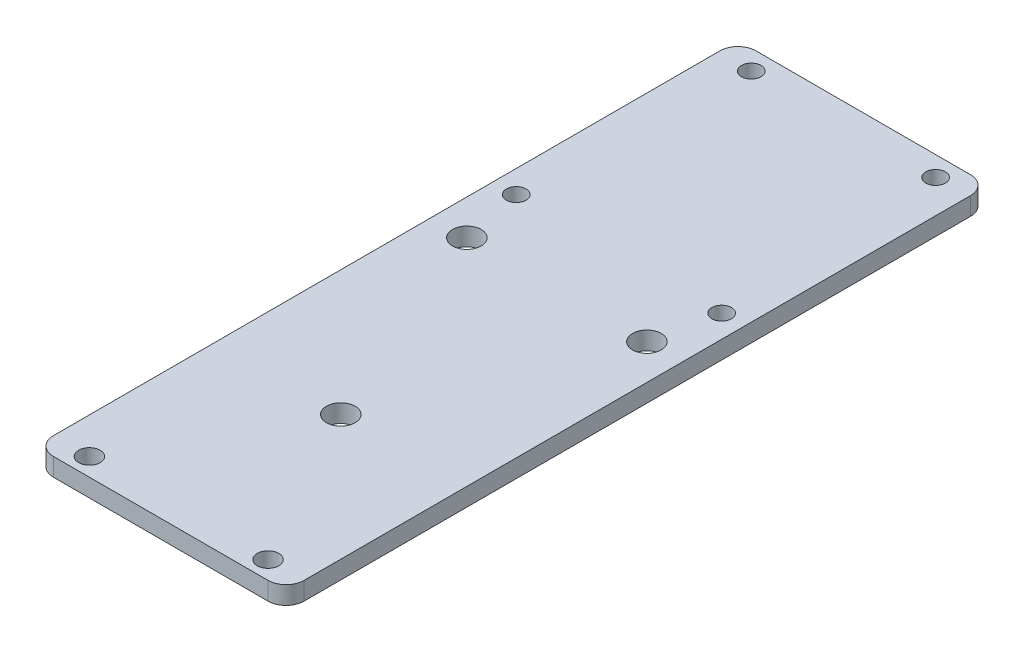
ISO-10303-21;
HEADER;
FILE_DESCRIPTION(('STEP AP214'),'2;1');
FILE_NAME('part.step','',(''),(''),'','','');
FILE_SCHEMA(('AUTOMOTIVE_DESIGN { 1 0 10303 214 1 1 1 1 }'));
ENDSEC;
DATA;
#1=APPLICATION_CONTEXT('core data for automotive mechanical design processes');
#2=APPLICATION_PROTOCOL_DEFINITION('international standard','automotive_design',2000,#1);
#3=PRODUCT_CONTEXT('',#1,'mechanical');
#4=PRODUCT('Part','Part','',(#3));
#5=PRODUCT_RELATED_PRODUCT_CATEGORY('part','',(#4));
#6=PRODUCT_DEFINITION_FORMATION('','',#4);
#7=PRODUCT_DEFINITION_CONTEXT('part definition',#1,'design');
#8=PRODUCT_DEFINITION('design','',#6,#7);
#9=PRODUCT_DEFINITION_SHAPE('','',#8);
#10=(LENGTH_UNIT() NAMED_UNIT(*) SI_UNIT(.MILLI.,.METRE.));
#11=(NAMED_UNIT(*) PLANE_ANGLE_UNIT() SI_UNIT($,.RADIAN.));
#12=(NAMED_UNIT(*) SI_UNIT($,.STERADIAN.) SOLID_ANGLE_UNIT());
#13=UNCERTAINTY_MEASURE_WITH_UNIT(LENGTH_MEASURE(1.E-05),#10,'distance_accuracy_value','');
#14=(GEOMETRIC_REPRESENTATION_CONTEXT(3) GLOBAL_UNCERTAINTY_ASSIGNED_CONTEXT((#13)) GLOBAL_UNIT_ASSIGNED_CONTEXT((#10,
#11,#12)) REPRESENTATION_CONTEXT('',''));
#15=CARTESIAN_POINT('',(0.,0.,0.));
#16=DIRECTION('',(0.,0.,1.));
#17=DIRECTION('',(1.,0.,0.));
#18=AXIS2_PLACEMENT_3D('',#15,#16,#17);
#19=CARTESIAN_POINT('',(-34.8250000000003,3.175,0.));
#20=DIRECTION('',(-1.,0.,0.));
#21=DIRECTION('',(0.,0.,1.));
#22=AXIS2_PLACEMENT_3D('',#19,#20,#21);
#23=PLANE('',#22);
#24=DIRECTION('',(0.,0.,-1.));
#25=VECTOR('',#24,1.);
#26=CARTESIAN_POINT('',(-34.8250000000003,0.,0.));
#27=LINE('',#26,#25);
#28=CARTESIAN_POINT('',(-34.8250000000003,0.,97.3596626939163));
#29=VERTEX_POINT('',#28);
#30=CARTESIAN_POINT('',(-34.8250000000003,0.,-20.1703373060838));
#31=VERTEX_POINT('',#30);
#32=EDGE_CURVE('E133',#29,#31,#27,.T.);
#33=ORIENTED_EDGE('',*,*,#32,.F.);
#34=DIRECTION('',(0.,-1.,0.));
#35=VECTOR('',#34,1.);
#36=CARTESIAN_POINT('',(-34.8250000000003,3.175,97.3596626939163));
#37=LINE('',#36,#35);
#38=CARTESIAN_POINT('',(-34.8250000000003,3.175,97.3596626939163));
#39=VERTEX_POINT('',#38);
#40=EDGE_CURVE('E156',#29,#39,#37,.F.);
#41=ORIENTED_EDGE('',*,*,#40,.T.);
#42=DIRECTION('',(0.,0.,-1.));
#43=VECTOR('',#42,1.);
#44=CARTESIAN_POINT('',(-34.8250000000003,3.175,0.));
#45=LINE('',#44,#43);
#46=CARTESIAN_POINT('',(-34.8250000000003,3.175,-20.1703373060838));
#47=VERTEX_POINT('',#46);
#48=EDGE_CURVE('E131',#39,#47,#45,.T.);
#49=ORIENTED_EDGE('',*,*,#48,.T.);
#50=DIRECTION('',(0.,-1.,0.));
#51=VECTOR('',#50,1.);
#52=CARTESIAN_POINT('',(-34.8250000000003,0.,-20.1703373060838));
#53=LINE('',#52,#51);
#54=EDGE_CURVE('E153',#47,#31,#53,.T.);
#55=ORIENTED_EDGE('',*,*,#54,.T.);
#56=EDGE_LOOP('',(#33,#41,#49,#55));
#57=FACE_BOUND('',#56,.T.);
#58=ADVANCED_FACE('F38',(#57),#23,.T.);
#59=CARTESIAN_POINT('',(0.,3.175,100.534662693916));
#60=DIRECTION('',(0.,0.,1.));
#61=DIRECTION('',(1.,0.,0.));
#62=AXIS2_PLACEMENT_3D('',#59,#60,#61);
#63=PLANE('',#62);
#64=DIRECTION('',(-1.,0.,0.));
#65=VECTOR('',#64,1.);
#66=CARTESIAN_POINT('',(0.,0.,100.534662693916));
#67=LINE('',#66,#65);
#68=CARTESIAN_POINT('',(6.19999999999975,0.,100.534662693916));
#69=VERTEX_POINT('',#68);
#70=CARTESIAN_POINT('',(-31.6500000000003,0.,100.534662693916));
#71=VERTEX_POINT('',#70);
#72=EDGE_CURVE('E129',#69,#71,#67,.T.);
#73=ORIENTED_EDGE('',*,*,#72,.F.);
#74=DIRECTION('',(0.,-1.,0.));
#75=VECTOR('',#74,1.);
#76=CARTESIAN_POINT('',(6.19999999999975,3.175,100.534662693916));
#77=LINE('',#76,#75);
#78=CARTESIAN_POINT('',(6.19999999999975,3.175,100.534662693916));
#79=VERTEX_POINT('',#78);
#80=EDGE_CURVE('E108',#69,#79,#77,.F.);
#81=ORIENTED_EDGE('',*,*,#80,.T.);
#82=DIRECTION('',(-1.,0.,0.));
#83=VECTOR('',#82,1.);
#84=CARTESIAN_POINT('',(0.,3.175,100.534662693916));
#85=LINE('',#84,#83);
#86=CARTESIAN_POINT('',(-31.6500000000003,3.175,100.534662693916));
#87=VERTEX_POINT('',#86);
#88=EDGE_CURVE('E172',#79,#87,#85,.T.);
#89=ORIENTED_EDGE('',*,*,#88,.T.);
#90=DIRECTION('',(0.,-1.,0.));
#91=VECTOR('',#90,1.);
#92=CARTESIAN_POINT('',(-31.6500000000003,3.175,100.534662693916));
#93=LINE('',#92,#91);
#94=EDGE_CURVE('E113',#87,#71,#93,.T.);
#95=ORIENTED_EDGE('',*,*,#94,.T.);
#96=EDGE_LOOP('',(#73,#81,#89,#95));
#97=FACE_BOUND('',#96,.T.);
#98=ADVANCED_FACE('F276',(#97),#63,.T.);
#99=CARTESIAN_POINT('',(9.37499999999975,3.175,0.));
#100=DIRECTION('',(-1.,0.,0.));
#101=DIRECTION('',(0.,0.,1.));
#102=AXIS2_PLACEMENT_3D('',#99,#100,#101);
#103=PLANE('',#102);
#104=DIRECTION('',(0.,0.,-1.));
#105=VECTOR('',#104,1.);
#106=CARTESIAN_POINT('',(9.37499999999975,3.175,0.));
#107=LINE('',#106,#105);
#108=CARTESIAN_POINT('',(9.37499999999975,3.175,97.3596626939163));
#109=VERTEX_POINT('',#108);
#110=CARTESIAN_POINT('',(9.37499999999975,3.175,-20.1703373060838));
#111=VERTEX_POINT('',#110);
#112=EDGE_CURVE('E122',#109,#111,#107,.T.);
#113=ORIENTED_EDGE('',*,*,#112,.F.);
#114=DIRECTION('',(0.,-1.,0.));
#115=VECTOR('',#114,1.);
#116=CARTESIAN_POINT('',(9.37499999999975,0.,97.3596626939163));
#117=LINE('',#116,#115);
#118=CARTESIAN_POINT('',(9.37499999999975,0.,97.3596626939163));
#119=VERTEX_POINT('',#118);
#120=EDGE_CURVE('E107',#109,#119,#117,.T.);
#121=ORIENTED_EDGE('',*,*,#120,.T.);
#122=DIRECTION('',(0.,0.,-1.));
#123=VECTOR('',#122,1.);
#124=CARTESIAN_POINT('',(9.37499999999975,0.,0.));
#125=LINE('',#124,#123);
#126=CARTESIAN_POINT('',(9.37499999999975,0.,-20.1703373060838));
#127=VERTEX_POINT('',#126);
#128=EDGE_CURVE('E120',#119,#127,#125,.T.);
#129=ORIENTED_EDGE('',*,*,#128,.T.);
#130=DIRECTION('',(0.,-1.,0.));
#131=VECTOR('',#130,1.);
#132=CARTESIAN_POINT('',(9.37499999999975,3.175,-20.1703373060838));
#133=LINE('',#132,#131);
#134=EDGE_CURVE('E124',#127,#111,#133,.F.);
#135=ORIENTED_EDGE('',*,*,#134,.T.);
#136=EDGE_LOOP('',(#113,#121,#129,#135));
#137=FACE_BOUND('',#136,.T.);
#138=ADVANCED_FACE('F119',(#137),#103,.F.);
#139=CARTESIAN_POINT('',(0.,3.175,-23.3453373060838));
#140=DIRECTION('',(0.,0.,1.));
#141=DIRECTION('',(1.,0.,0.));
#142=AXIS2_PLACEMENT_3D('',#139,#140,#141);
#143=PLANE('',#142);
#144=DIRECTION('',(-1.,0.,0.));
#145=VECTOR('',#144,1.);
#146=CARTESIAN_POINT('',(0.,0.,-23.3453373060838));
#147=LINE('',#146,#145);
#148=CARTESIAN_POINT('',(6.19999999999975,0.,-23.3453373060838));
#149=VERTEX_POINT('',#148);
#150=CARTESIAN_POINT('',(-31.6500000000003,0.,-23.3453373060838));
#151=VERTEX_POINT('',#150);
#152=EDGE_CURVE('E128',#149,#151,#147,.T.);
#153=ORIENTED_EDGE('',*,*,#152,.T.);
#154=DIRECTION('',(0.,-1.,0.));
#155=VECTOR('',#154,1.);
#156=CARTESIAN_POINT('',(-31.6500000000003,3.175,-23.3453373060838));
#157=LINE('',#156,#155);
#158=CARTESIAN_POINT('',(-31.6500000000003,3.175,-23.3453373060838));
#159=VERTEX_POINT('',#158);
#160=EDGE_CURVE('E11',#151,#159,#157,.F.);
#161=ORIENTED_EDGE('',*,*,#160,.T.);
#162=DIRECTION('',(-1.,0.,0.));
#163=VECTOR('',#162,1.);
#164=CARTESIAN_POINT('',(0.,3.175,-23.3453373060838));
#165=LINE('',#164,#163);
#166=CARTESIAN_POINT('',(6.19999999999975,3.175,-23.3453373060838));
#167=VERTEX_POINT('',#166);
#168=EDGE_CURVE('E137',#167,#159,#165,.T.);
#169=ORIENTED_EDGE('',*,*,#168,.F.);
#170=DIRECTION('',(0.,-1.,0.));
#171=VECTOR('',#170,1.);
#172=CARTESIAN_POINT('',(6.19999999999975,3.175,-23.3453373060838));
#173=LINE('',#172,#171);
#174=EDGE_CURVE('E46',#167,#149,#173,.T.);
#175=ORIENTED_EDGE('',*,*,#174,.T.);
#176=EDGE_LOOP('',(#153,#161,#169,#175));
#177=FACE_BOUND('',#176,.T.);
#178=ADVANCED_FACE('F159',(#177),#143,.F.);
#179=CARTESIAN_POINT('',(0.,3.175,0.));
#180=DIRECTION('',(0.,1.,0.));
#181=DIRECTION('',(0.,0.,1.));
#182=AXIS2_PLACEMENT_3D('',#179,#180,#181);
#183=PLANE('',#182);
#184=CARTESIAN_POINT('',(3.14999999999975,3.175,30.6846626939163));
#185=DIRECTION('',(0.,-1.,0.));
#186=DIRECTION('',(0.,0.,-1.));
#187=AXIS2_PLACEMENT_3D('',#184,#185,#186);
#188=CIRCLE('',#187,2.5273);
#189=CARTESIAN_POINT('',(3.14999999999975,3.175,28.1573626939163));
#190=VERTEX_POINT('',#189);
#191=EDGE_CURVE('E231',#190,#190,#188,.T.);
#192=ORIENTED_EDGE('',*,*,#191,.T.);
#193=EDGE_LOOP('',(#192));
#194=FACE_BOUND('',#193,.T.);
#195=CARTESIAN_POINT('',(-28.6000000000002,3.175,30.6846626939163));
#196=DIRECTION('',(0.,-1.,0.));
#197=DIRECTION('',(0.,0.,-1.));
#198=AXIS2_PLACEMENT_3D('',#195,#196,#197);
#199=CIRCLE('',#198,2.5273);
#200=CARTESIAN_POINT('',(-28.6000000000002,3.175,28.1573626939163));
#201=VERTEX_POINT('',#200);
#202=EDGE_CURVE('E225',#201,#201,#199,.T.);
#203=ORIENTED_EDGE('',*,*,#202,.T.);
#204=EDGE_LOOP('',(#203));
#205=FACE_BOUND('',#204,.T.);
#206=CARTESIAN_POINT('',(-12.7250000000003,3.175,68.7846626939163));
#207=DIRECTION('',(0.,-1.,0.));
#208=DIRECTION('',(0.,0.,-1.));
#209=AXIS2_PLACEMENT_3D('',#206,#207,#208);
#210=CIRCLE('',#209,2.5273);
#211=CARTESIAN_POINT('',(-12.7250000000003,3.175,66.2573626939163));
#212=VERTEX_POINT('',#211);
#213=EDGE_CURVE('E219',#212,#212,#210,.T.);
#214=ORIENTED_EDGE('',*,*,#213,.T.);
#215=EDGE_LOOP('',(#214));
#216=FACE_BOUND('',#215,.T.);
#217=CARTESIAN_POINT('',(3.02499999999975,3.175,97.3596626939163));
#218=DIRECTION('',(0.,1.,0.));
#219=DIRECTION('',(0.,0.,1.));
#220=AXIS2_PLACEMENT_3D('',#217,#218,#219);
#221=CIRCLE('',#220,1.89865);
#222=CARTESIAN_POINT('',(3.02499999999975,3.175,99.2583126939163));
#223=VERTEX_POINT('',#222);
#224=EDGE_CURVE('E216',#223,#223,#221,.T.);
#225=ORIENTED_EDGE('',*,*,#224,.F.);
#226=EDGE_LOOP('',(#225));
#227=FACE_BOUND('',#226,.T.);
#228=CARTESIAN_POINT('',(-28.4750000000003,3.175,97.3596626939163));
#229=DIRECTION('',(0.,1.,0.));
#230=DIRECTION('',(0.,0.,1.));
#231=AXIS2_PLACEMENT_3D('',#228,#229,#230);
#232=CIRCLE('',#231,1.89865);
#233=CARTESIAN_POINT('',(-28.4750000000003,3.175,99.2583126939163));
#234=VERTEX_POINT('',#233);
#235=EDGE_CURVE('E210',#234,#234,#232,.T.);
#236=ORIENTED_EDGE('',*,*,#235,.F.);
#237=EDGE_LOOP('',(#236));
#238=FACE_BOUND('',#237,.T.);
#239=CARTESIAN_POINT('',(-28.9750000000003,3.175,-19.8453373060838));
#240=DIRECTION('',(0.,-1.,0.));
#241=DIRECTION('',(0.,0.,-1.));
#242=AXIS2_PLACEMENT_3D('',#239,#240,#241);
#243=CIRCLE('',#242,1.7272);
#244=CARTESIAN_POINT('',(-28.9750000000003,3.175,-21.5725373060838));
#245=VERTEX_POINT('',#244);
#246=EDGE_CURVE('E201',#245,#245,#243,.T.);
#247=ORIENTED_EDGE('',*,*,#246,.T.);
#248=EDGE_LOOP('',(#247));
#249=FACE_BOUND('',#248,.T.);
#250=CARTESIAN_POINT('',(3.52499999999973,3.175,-19.8453373060838));
#251=DIRECTION('',(0.,-1.,0.));
#252=DIRECTION('',(0.,0.,-1.));
#253=AXIS2_PLACEMENT_3D('',#250,#251,#252);
#254=CIRCLE('',#253,1.7272);
#255=CARTESIAN_POINT('',(3.52499999999973,3.175,-21.5725373060838));
#256=VERTEX_POINT('',#255);
#257=EDGE_CURVE('E195',#256,#256,#254,.T.);
#258=ORIENTED_EDGE('',*,*,#257,.T.);
#259=EDGE_LOOP('',(#258));
#260=FACE_BOUND('',#259,.T.);
#261=CARTESIAN_POINT('',(5.38519999999973,3.175,19.7378626939162));
#262=DIRECTION('',(0.,-1.,0.));
#263=DIRECTION('',(0.,0.,-1.));
#264=AXIS2_PLACEMENT_3D('',#261,#262,#263);
#265=CIRCLE('',#264,1.7272);
#266=CARTESIAN_POINT('',(5.38519999999973,3.175,18.0106626939162));
#267=VERTEX_POINT('',#266);
#268=EDGE_CURVE('E186',#267,#267,#265,.T.);
#269=ORIENTED_EDGE('',*,*,#268,.T.);
#270=EDGE_LOOP('',(#269));
#271=FACE_BOUND('',#270,.T.);
#272=CARTESIAN_POINT('',(-30.8352000000003,3.175,19.7378626939162));
#273=DIRECTION('',(0.,-1.,0.));
#274=DIRECTION('',(0.,0.,-1.));
#275=AXIS2_PLACEMENT_3D('',#272,#273,#274);
#276=CIRCLE('',#275,1.7272);
#277=CARTESIAN_POINT('',(-30.8352000000003,3.175,18.0106626939162));
#278=VERTEX_POINT('',#277);
#279=EDGE_CURVE('E177',#278,#278,#276,.T.);
#280=ORIENTED_EDGE('',*,*,#279,.T.);
#281=EDGE_LOOP('',(#280));
#282=FACE_BOUND('',#281,.T.);
#283=ORIENTED_EDGE('',*,*,#88,.F.);
#284=CARTESIAN_POINT('',(6.19999999999975,3.175,97.3596626939163));
#285=DIRECTION('',(0.,1.,0.));
#286=DIRECTION('',(0.,0.,1.));
#287=AXIS2_PLACEMENT_3D('',#284,#285,#286);
#288=CIRCLE('',#287,3.175);
#289=EDGE_CURVE('E151',#79,#109,#288,.T.);
#290=ORIENTED_EDGE('',*,*,#289,.T.);
#291=ORIENTED_EDGE('',*,*,#112,.T.);
#292=CARTESIAN_POINT('',(6.19999999999975,3.175,-20.1703373060838));
#293=DIRECTION('',(0.,1.,0.));
#294=DIRECTION('',(0.,0.,1.));
#295=AXIS2_PLACEMENT_3D('',#292,#293,#294);
#296=CIRCLE('',#295,3.175);
#297=EDGE_CURVE('E58',#111,#167,#296,.T.);
#298=ORIENTED_EDGE('',*,*,#297,.T.);
#299=ORIENTED_EDGE('',*,*,#168,.T.);
#300=CARTESIAN_POINT('',(-31.6500000000003,3.175,-20.1703373060838));
#301=DIRECTION('',(0.,1.,0.));
#302=DIRECTION('',(0.,0.,1.));
#303=AXIS2_PLACEMENT_3D('',#300,#301,#302);
#304=CIRCLE('',#303,3.175);
#305=EDGE_CURVE('E147',#159,#47,#304,.T.);
#306=ORIENTED_EDGE('',*,*,#305,.T.);
#307=ORIENTED_EDGE('',*,*,#48,.F.);
#308=CARTESIAN_POINT('',(-31.6500000000003,3.175,97.3596626939163));
#309=DIRECTION('',(0.,1.,0.));
#310=DIRECTION('',(0.,0.,1.));
#311=AXIS2_PLACEMENT_3D('',#308,#309,#310);
#312=CIRCLE('',#311,3.175);
#313=EDGE_CURVE('E149',#39,#87,#312,.T.);
#314=ORIENTED_EDGE('',*,*,#313,.T.);
#315=EDGE_LOOP('',(#283,#290,#291,#298,#299,#306,#307,#314));
#316=FACE_BOUND('',#315,.T.);
#317=ADVANCED_FACE('F243',(#194,#205,#216,#227,#238,#249,#260,#271,#282,#316),#183,.T.);
#318=CARTESIAN_POINT('',(0.,0.,0.));
#319=DIRECTION('',(0.,1.,0.));
#320=DIRECTION('',(0.,0.,1.));
#321=AXIS2_PLACEMENT_3D('',#318,#319,#320);
#322=PLANE('',#321);
#323=CARTESIAN_POINT('',(3.14999999999975,0.,30.6846626939163));
#324=DIRECTION('',(0.,-1.,0.));
#325=DIRECTION('',(0.,0.,-1.));
#326=AXIS2_PLACEMENT_3D('',#323,#324,#325);
#327=CIRCLE('',#326,2.5273);
#328=CARTESIAN_POINT('',(3.14999999999975,0.,28.1573626939163));
#329=VERTEX_POINT('',#328);
#330=EDGE_CURVE('E234',#329,#329,#327,.T.);
#331=ORIENTED_EDGE('',*,*,#330,.F.);
#332=EDGE_LOOP('',(#331));
#333=FACE_BOUND('',#332,.T.);
#334=CARTESIAN_POINT('',(-28.6000000000002,0.,30.6846626939163));
#335=DIRECTION('',(0.,-1.,0.));
#336=DIRECTION('',(0.,0.,-1.));
#337=AXIS2_PLACEMENT_3D('',#334,#335,#336);
#338=CIRCLE('',#337,2.5273);
#339=CARTESIAN_POINT('',(-28.6000000000002,0.,28.1573626939163));
#340=VERTEX_POINT('',#339);
#341=EDGE_CURVE('E228',#340,#340,#338,.T.);
#342=ORIENTED_EDGE('',*,*,#341,.F.);
#343=EDGE_LOOP('',(#342));
#344=FACE_BOUND('',#343,.T.);
#345=CARTESIAN_POINT('',(-12.7250000000003,0.,68.7846626939163));
#346=DIRECTION('',(0.,-1.,0.));
#347=DIRECTION('',(0.,0.,-1.));
#348=AXIS2_PLACEMENT_3D('',#345,#346,#347);
#349=CIRCLE('',#348,2.5273);
#350=CARTESIAN_POINT('',(-12.7250000000003,0.,66.2573626939163));
#351=VERTEX_POINT('',#350);
#352=EDGE_CURVE('E222',#351,#351,#349,.T.);
#353=ORIENTED_EDGE('',*,*,#352,.F.);
#354=EDGE_LOOP('',(#353));
#355=FACE_BOUND('',#354,.T.);
#356=CARTESIAN_POINT('',(3.02499999999975,0.,97.3596626939163));
#357=DIRECTION('',(0.,1.,0.));
#358=DIRECTION('',(0.,0.,1.));
#359=AXIS2_PLACEMENT_3D('',#356,#357,#358);
#360=CIRCLE('',#359,1.89865);
#361=CARTESIAN_POINT('',(3.02499999999975,0.,99.2583126939163));
#362=VERTEX_POINT('',#361);
#363=EDGE_CURVE('E213',#362,#362,#360,.T.);
#364=ORIENTED_EDGE('',*,*,#363,.T.);
#365=EDGE_LOOP('',(#364));
#366=FACE_BOUND('',#365,.T.);
#367=CARTESIAN_POINT('',(-28.4750000000003,0.,97.3596626939163));
#368=DIRECTION('',(0.,1.,0.));
#369=DIRECTION('',(0.,0.,1.));
#370=AXIS2_PLACEMENT_3D('',#367,#368,#369);
#371=CIRCLE('',#370,1.89865);
#372=CARTESIAN_POINT('',(-28.4750000000003,0.,99.2583126939163));
#373=VERTEX_POINT('',#372);
#374=EDGE_CURVE('E207',#373,#373,#371,.T.);
#375=ORIENTED_EDGE('',*,*,#374,.T.);
#376=EDGE_LOOP('',(#375));
#377=FACE_BOUND('',#376,.T.);
#378=CARTESIAN_POINT('',(-28.9750000000003,0.,-19.8453373060838));
#379=DIRECTION('',(0.,-1.,0.));
#380=DIRECTION('',(0.,0.,-1.));
#381=AXIS2_PLACEMENT_3D('',#378,#379,#380);
#382=CIRCLE('',#381,1.7272);
#383=CARTESIAN_POINT('',(-28.9750000000003,0.,-21.5725373060838));
#384=VERTEX_POINT('',#383);
#385=EDGE_CURVE('E204',#384,#384,#382,.T.);
#386=ORIENTED_EDGE('',*,*,#385,.F.);
#387=EDGE_LOOP('',(#386));
#388=FACE_BOUND('',#387,.T.);
#389=CARTESIAN_POINT('',(3.52499999999973,0.,-19.8453373060838));
#390=DIRECTION('',(0.,-1.,0.));
#391=DIRECTION('',(0.,0.,-1.));
#392=AXIS2_PLACEMENT_3D('',#389,#390,#391);
#393=CIRCLE('',#392,1.7272);
#394=CARTESIAN_POINT('',(3.52499999999973,0.,-21.5725373060838));
#395=VERTEX_POINT('',#394);
#396=EDGE_CURVE('E198',#395,#395,#393,.T.);
#397=ORIENTED_EDGE('',*,*,#396,.F.);
#398=EDGE_LOOP('',(#397));
#399=FACE_BOUND('',#398,.T.);
#400=CARTESIAN_POINT('',(5.38519999999973,0.,19.7378626939162));
#401=DIRECTION('',(0.,-1.,0.));
#402=DIRECTION('',(0.,0.,-1.));
#403=AXIS2_PLACEMENT_3D('',#400,#401,#402);
#404=CIRCLE('',#403,1.7272);
#405=CARTESIAN_POINT('',(5.38519999999973,0.,18.0106626939162));
#406=VERTEX_POINT('',#405);
#407=EDGE_CURVE('E190',#406,#406,#404,.T.);
#408=ORIENTED_EDGE('',*,*,#407,.F.);
#409=EDGE_LOOP('',(#408));
#410=FACE_BOUND('',#409,.T.);
#411=CARTESIAN_POINT('',(-30.8352000000003,0.,19.7378626939162));
#412=DIRECTION('',(0.,-1.,0.));
#413=DIRECTION('',(0.,0.,-1.));
#414=AXIS2_PLACEMENT_3D('',#411,#412,#413);
#415=CIRCLE('',#414,1.7272);
#416=CARTESIAN_POINT('',(-30.8352000000003,0.,18.0106626939162));
#417=VERTEX_POINT('',#416);
#418=EDGE_CURVE('E182',#417,#417,#415,.T.);
#419=ORIENTED_EDGE('',*,*,#418,.F.);
#420=EDGE_LOOP('',(#419));
#421=FACE_BOUND('',#420,.T.);
#422=ORIENTED_EDGE('',*,*,#128,.F.);
#423=CARTESIAN_POINT('',(6.19999999999975,0.,97.3596626939163));
#424=DIRECTION('',(0.,1.,0.));
#425=DIRECTION('',(0.,0.,1.));
#426=AXIS2_PLACEMENT_3D('',#423,#424,#425);
#427=CIRCLE('',#426,3.175);
#428=EDGE_CURVE('E103',#119,#69,#427,.F.);
#429=ORIENTED_EDGE('',*,*,#428,.T.);
#430=ORIENTED_EDGE('',*,*,#72,.T.);
#431=CARTESIAN_POINT('',(-31.6500000000003,0.,97.3596626939163));
#432=DIRECTION('',(0.,1.,0.));
#433=DIRECTION('',(0.,0.,1.));
#434=AXIS2_PLACEMENT_3D('',#431,#432,#433);
#435=CIRCLE('',#434,3.175);
#436=EDGE_CURVE('E114',#71,#29,#435,.F.);
#437=ORIENTED_EDGE('',*,*,#436,.T.);
#438=ORIENTED_EDGE('',*,*,#32,.T.);
#439=CARTESIAN_POINT('',(-31.6500000000003,0.,-20.1703373060838));
#440=DIRECTION('',(0.,1.,0.));
#441=DIRECTION('',(0.,0.,1.));
#442=AXIS2_PLACEMENT_3D('',#439,#440,#441);
#443=CIRCLE('',#442,3.175);
#444=EDGE_CURVE('E140',#31,#151,#443,.F.);
#445=ORIENTED_EDGE('',*,*,#444,.T.);
#446=ORIENTED_EDGE('',*,*,#152,.F.);
#447=CARTESIAN_POINT('',(6.19999999999975,0.,-20.1703373060838));
#448=DIRECTION('',(0.,1.,0.));
#449=DIRECTION('',(0.,0.,1.));
#450=AXIS2_PLACEMENT_3D('',#447,#448,#449);
#451=CIRCLE('',#450,3.175);
#452=EDGE_CURVE('E123',#149,#127,#451,.F.);
#453=ORIENTED_EDGE('',*,*,#452,.T.);
#454=EDGE_LOOP('',(#422,#429,#430,#437,#438,#445,#446,#453));
#455=FACE_BOUND('',#454,.T.);
#456=ADVANCED_FACE('F126',(#333,#344,#355,#366,#377,#388,#399,#410,#421,#455),#322,.F.);
#457=CARTESIAN_POINT('',(-30.8352000000003,0.,19.7378626939162));
#458=DIRECTION('',(0.,-1.,0.));
#459=DIRECTION('',(0.,0.,-1.));
#460=AXIS2_PLACEMENT_3D('',#457,#458,#459);
#461=CYLINDRICAL_SURFACE('',#460,1.7272);
#462=ORIENTED_EDGE('',*,*,#279,.F.);
#463=EDGE_LOOP('',(#462));
#464=FACE_BOUND('',#463,.T.);
#465=ORIENTED_EDGE('',*,*,#418,.T.);
#466=EDGE_LOOP('',(#465));
#467=FACE_BOUND('',#466,.T.);
#468=ADVANCED_FACE('F242',(#464,#467),#461,.F.);
#469=CARTESIAN_POINT('',(5.38519999999973,0.,19.7378626939162));
#470=DIRECTION('',(0.,-1.,0.));
#471=DIRECTION('',(0.,0.,-1.));
#472=AXIS2_PLACEMENT_3D('',#469,#470,#471);
#473=CYLINDRICAL_SURFACE('',#472,1.7272);
#474=ORIENTED_EDGE('',*,*,#268,.F.);
#475=EDGE_LOOP('',(#474));
#476=FACE_BOUND('',#475,.T.);
#477=ORIENTED_EDGE('',*,*,#407,.T.);
#478=EDGE_LOOP('',(#477));
#479=FACE_BOUND('',#478,.T.);
#480=ADVANCED_FACE('F260',(#476,#479),#473,.F.);
#481=CARTESIAN_POINT('',(3.52499999999973,0.,-19.8453373060838));
#482=DIRECTION('',(0.,-1.,0.));
#483=DIRECTION('',(0.,0.,-1.));
#484=AXIS2_PLACEMENT_3D('',#481,#482,#483);
#485=CYLINDRICAL_SURFACE('',#484,1.7272);
#486=ORIENTED_EDGE('',*,*,#257,.F.);
#487=EDGE_LOOP('',(#486));
#488=FACE_BOUND('',#487,.T.);
#489=ORIENTED_EDGE('',*,*,#396,.T.);
#490=EDGE_LOOP('',(#489));
#491=FACE_BOUND('',#490,.T.);
#492=ADVANCED_FACE('F262',(#488,#491),#485,.F.);
#493=CARTESIAN_POINT('',(-28.9750000000003,0.,-19.8453373060838));
#494=DIRECTION('',(0.,-1.,0.));
#495=DIRECTION('',(0.,0.,-1.));
#496=AXIS2_PLACEMENT_3D('',#493,#494,#495);
#497=CYLINDRICAL_SURFACE('',#496,1.7272);
#498=ORIENTED_EDGE('',*,*,#246,.F.);
#499=EDGE_LOOP('',(#498));
#500=FACE_BOUND('',#499,.T.);
#501=ORIENTED_EDGE('',*,*,#385,.T.);
#502=EDGE_LOOP('',(#501));
#503=FACE_BOUND('',#502,.T.);
#504=ADVANCED_FACE('F269',(#500,#503),#497,.F.);
#505=CARTESIAN_POINT('',(-28.4750000000003,3.175,97.3596626939163));
#506=DIRECTION('',(0.,1.,0.));
#507=DIRECTION('',(0.,0.,1.));
#508=AXIS2_PLACEMENT_3D('',#505,#506,#507);
#509=CYLINDRICAL_SURFACE('',#508,1.89865);
#510=ORIENTED_EDGE('',*,*,#374,.F.);
#511=EDGE_LOOP('',(#510));
#512=FACE_BOUND('',#511,.T.);
#513=ORIENTED_EDGE('',*,*,#235,.T.);
#514=EDGE_LOOP('',(#513));
#515=FACE_BOUND('',#514,.T.);
#516=ADVANCED_FACE('F385',(#512,#515),#509,.F.);
#517=CARTESIAN_POINT('',(3.02499999999975,3.175,97.3596626939163));
#518=DIRECTION('',(0.,1.,0.));
#519=DIRECTION('',(0.,0.,1.));
#520=AXIS2_PLACEMENT_3D('',#517,#518,#519);
#521=CYLINDRICAL_SURFACE('',#520,1.89865);
#522=ORIENTED_EDGE('',*,*,#363,.F.);
#523=EDGE_LOOP('',(#522));
#524=FACE_BOUND('',#523,.T.);
#525=ORIENTED_EDGE('',*,*,#224,.T.);
#526=EDGE_LOOP('',(#525));
#527=FACE_BOUND('',#526,.T.);
#528=ADVANCED_FACE('F288',(#524,#527),#521,.F.);
#529=CARTESIAN_POINT('',(6.19999999999975,3.175,97.3596626939163));
#530=DIRECTION('',(0.,1.,0.));
#531=DIRECTION('',(0.,0.,1.));
#532=AXIS2_PLACEMENT_3D('',#529,#530,#531);
#533=CYLINDRICAL_SURFACE('',#532,3.175);
#534=ORIENTED_EDGE('',*,*,#289,.F.);
#535=ORIENTED_EDGE('',*,*,#80,.F.);
#536=ORIENTED_EDGE('',*,*,#428,.F.);
#537=ORIENTED_EDGE('',*,*,#120,.F.);
#538=EDGE_LOOP('',(#534,#535,#536,#537));
#539=FACE_BOUND('',#538,.T.);
#540=ADVANCED_FACE('F106',(#539),#533,.T.);
#541=CARTESIAN_POINT('',(-31.6500000000003,3.175,97.3596626939163));
#542=DIRECTION('',(0.,-1.,0.));
#543=DIRECTION('',(0.,0.,-1.));
#544=AXIS2_PLACEMENT_3D('',#541,#542,#543);
#545=CYLINDRICAL_SURFACE('',#544,3.175);
#546=ORIENTED_EDGE('',*,*,#313,.F.);
#547=ORIENTED_EDGE('',*,*,#40,.F.);
#548=ORIENTED_EDGE('',*,*,#436,.F.);
#549=ORIENTED_EDGE('',*,*,#94,.F.);
#550=EDGE_LOOP('',(#546,#547,#548,#549));
#551=FACE_BOUND('',#550,.T.);
#552=ADVANCED_FACE('F287',(#551),#545,.T.);
#553=CARTESIAN_POINT('',(-31.6500000000003,3.175,-20.1703373060838));
#554=DIRECTION('',(0.,1.,0.));
#555=DIRECTION('',(0.,0.,1.));
#556=AXIS2_PLACEMENT_3D('',#553,#554,#555);
#557=CYLINDRICAL_SURFACE('',#556,3.175);
#558=ORIENTED_EDGE('',*,*,#305,.F.);
#559=ORIENTED_EDGE('',*,*,#160,.F.);
#560=ORIENTED_EDGE('',*,*,#444,.F.);
#561=ORIENTED_EDGE('',*,*,#54,.F.);
#562=EDGE_LOOP('',(#558,#559,#560,#561));
#563=FACE_BOUND('',#562,.T.);
#564=ADVANCED_FACE('F166',(#563),#557,.T.);
#565=CARTESIAN_POINT('',(6.19999999999975,3.175,-20.1703373060838));
#566=DIRECTION('',(0.,-1.,0.));
#567=DIRECTION('',(0.,0.,-1.));
#568=AXIS2_PLACEMENT_3D('',#565,#566,#567);
#569=CYLINDRICAL_SURFACE('',#568,3.175);
#570=ORIENTED_EDGE('',*,*,#297,.F.);
#571=ORIENTED_EDGE('',*,*,#134,.F.);
#572=ORIENTED_EDGE('',*,*,#452,.F.);
#573=ORIENTED_EDGE('',*,*,#174,.F.);
#574=EDGE_LOOP('',(#570,#571,#572,#573));
#575=FACE_BOUND('',#574,.T.);
#576=ADVANCED_FACE('F40',(#575),#569,.T.);
#577=CARTESIAN_POINT('',(-12.7250000000003,0.,68.7846626939163));
#578=DIRECTION('',(0.,-1.,0.));
#579=DIRECTION('',(0.,0.,-1.));
#580=AXIS2_PLACEMENT_3D('',#577,#578,#579);
#581=CYLINDRICAL_SURFACE('',#580,2.5273);
#582=ORIENTED_EDGE('',*,*,#213,.F.);
#583=EDGE_LOOP('',(#582));
#584=FACE_BOUND('',#583,.T.);
#585=ORIENTED_EDGE('',*,*,#352,.T.);
#586=EDGE_LOOP('',(#585));
#587=FACE_BOUND('',#586,.T.);
#588=ADVANCED_FACE('F295',(#584,#587),#581,.F.);
#589=CARTESIAN_POINT('',(-28.6000000000002,0.,30.6846626939163));
#590=DIRECTION('',(0.,-1.,0.));
#591=DIRECTION('',(0.,0.,-1.));
#592=AXIS2_PLACEMENT_3D('',#589,#590,#591);
#593=CYLINDRICAL_SURFACE('',#592,2.5273);
#594=ORIENTED_EDGE('',*,*,#202,.F.);
#595=EDGE_LOOP('',(#594));
#596=FACE_BOUND('',#595,.T.);
#597=ORIENTED_EDGE('',*,*,#341,.T.);
#598=EDGE_LOOP('',(#597));
#599=FACE_BOUND('',#598,.T.);
#600=ADVANCED_FACE('F299',(#596,#599),#593,.F.);
#601=CARTESIAN_POINT('',(3.14999999999975,0.,30.6846626939163));
#602=DIRECTION('',(0.,-1.,0.));
#603=DIRECTION('',(0.,0.,-1.));
#604=AXIS2_PLACEMENT_3D('',#601,#602,#603);
#605=CYLINDRICAL_SURFACE('',#604,2.5273);
#606=ORIENTED_EDGE('',*,*,#191,.F.);
#607=EDGE_LOOP('',(#606));
#608=FACE_BOUND('',#607,.T.);
#609=ORIENTED_EDGE('',*,*,#330,.T.);
#610=EDGE_LOOP('',(#609));
#611=FACE_BOUND('',#610,.T.);
#612=ADVANCED_FACE('F238',(#608,#611),#605,.F.);
#613=CLOSED_SHELL('',(#58,#98,#138,#178,#317,#456,#468,#480,#492,#504,#516,#528,#540,#552,#564,
#576,#588,#600,#612));
#614=MANIFOLD_SOLID_BREP('B2',#613);
#615=ADVANCED_BREP_SHAPE_REPRESENTATION('',(#18,#614),#14);
#616=SHAPE_DEFINITION_REPRESENTATION(#9,#615);
ENDSEC;
END-ISO-10303-21;
